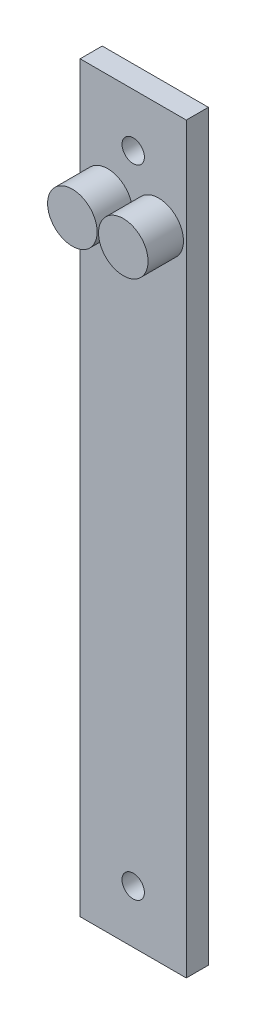
ISO-10303-21;
HEADER;
FILE_DESCRIPTION(('STEP AP214'),'2;1');
FILE_NAME('part.step','',(''),(''),'','','');
FILE_SCHEMA(('AUTOMOTIVE_DESIGN { 1 0 10303 214 1 1 1 1 }'));
ENDSEC;
DATA;
#1=APPLICATION_CONTEXT('core data for automotive mechanical design processes');
#2=APPLICATION_PROTOCOL_DEFINITION('international standard','automotive_design',2000,#1);
#3=PRODUCT_CONTEXT('',#1,'mechanical');
#4=PRODUCT('Part','Part','',(#3));
#5=PRODUCT_RELATED_PRODUCT_CATEGORY('part','',(#4));
#6=PRODUCT_DEFINITION_FORMATION('','',#4);
#7=PRODUCT_DEFINITION_CONTEXT('part definition',#1,'design');
#8=PRODUCT_DEFINITION('design','',#6,#7);
#9=PRODUCT_DEFINITION_SHAPE('','',#8);
#10=(LENGTH_UNIT() NAMED_UNIT(*) SI_UNIT(.MILLI.,.METRE.));
#11=(NAMED_UNIT(*) PLANE_ANGLE_UNIT() SI_UNIT($,.RADIAN.));
#12=(NAMED_UNIT(*) SI_UNIT($,.STERADIAN.) SOLID_ANGLE_UNIT());
#13=UNCERTAINTY_MEASURE_WITH_UNIT(LENGTH_MEASURE(1.E-05),#10,'distance_accuracy_value','');
#14=(GEOMETRIC_REPRESENTATION_CONTEXT(3) GLOBAL_UNCERTAINTY_ASSIGNED_CONTEXT((#13)) GLOBAL_UNIT_ASSIGNED_CONTEXT((#10,
#11,#12)) REPRESENTATION_CONTEXT('',''));
#15=CARTESIAN_POINT('',(0.,0.,0.));
#16=DIRECTION('',(0.,0.,1.));
#17=DIRECTION('',(1.,0.,0.));
#18=AXIS2_PLACEMENT_3D('',#15,#16,#17);
#19=CARTESIAN_POINT('',(0.,0.,7.9375));
#20=DIRECTION('',(0.,0.,1.));
#21=DIRECTION('',(1.,0.,0.));
#22=AXIS2_PLACEMENT_3D('',#19,#20,#21);
#23=PLANE('',#22);
#24=CARTESIAN_POINT('',(-9.14400000000001,95.25,7.9375));
#25=DIRECTION('',(0.,0.,1.));
#26=DIRECTION('',(1.,0.,0.));
#27=AXIS2_PLACEMENT_3D('',#24,#25,#26);
#28=CIRCLE('',#27,8.89);
#29=CARTESIAN_POINT('',(-0.254000000000013,95.25,7.9375));
#30=VERTEX_POINT('',#29);
#31=EDGE_CURVE('E126',#30,#30,#28,.T.);
#32=ORIENTED_EDGE('',*,*,#31,.F.);
#33=EDGE_LOOP('',(#32));
#34=FACE_BOUND('',#33,.T.);
#35=CARTESIAN_POINT('',(0.,-114.3,7.9375));
#36=DIRECTION('',(0.,0.,1.));
#37=DIRECTION('',(1.,0.,0.));
#38=AXIS2_PLACEMENT_3D('',#35,#36,#37);
#39=CIRCLE('',#38,4.0132);
#40=CARTESIAN_POINT('',(4.0132,-114.3,7.9375));
#41=VERTEX_POINT('',#40);
#42=EDGE_CURVE('E122',#41,#41,#39,.T.);
#43=ORIENTED_EDGE('',*,*,#42,.F.);
#44=EDGE_LOOP('',(#43));
#45=FACE_BOUND('',#44,.T.);
#46=CARTESIAN_POINT('',(0.,114.3,7.9375));
#47=DIRECTION('',(0.,0.,1.));
#48=DIRECTION('',(1.,0.,0.));
#49=AXIS2_PLACEMENT_3D('',#46,#47,#48);
#50=CIRCLE('',#49,4.0132);
#51=CARTESIAN_POINT('',(4.0132,114.3,7.9375));
#52=VERTEX_POINT('',#51);
#53=EDGE_CURVE('E116',#52,#52,#50,.T.);
#54=ORIENTED_EDGE('',*,*,#53,.F.);
#55=EDGE_LOOP('',(#54));
#56=FACE_BOUND('',#55,.T.);
#57=DIRECTION('',(0.,-1.,0.));
#58=VECTOR('',#57,1.);
#59=CARTESIAN_POINT('',(-19.05,133.35,7.9375));
#60=LINE('',#59,#58);
#61=CARTESIAN_POINT('',(-19.05,133.35,7.9375));
#62=VERTEX_POINT('',#61);
#63=CARTESIAN_POINT('',(-19.05,-133.35,7.9375));
#64=VERTEX_POINT('',#63);
#65=EDGE_CURVE('E88',#62,#64,#60,.T.);
#66=ORIENTED_EDGE('',*,*,#65,.T.);
#67=DIRECTION('',(1.,0.,0.));
#68=VECTOR('',#67,1.);
#69=CARTESIAN_POINT('',(-19.05,-133.35,7.9375));
#70=LINE('',#69,#68);
#71=CARTESIAN_POINT('',(19.05,-133.35,7.9375));
#72=VERTEX_POINT('',#71);
#73=EDGE_CURVE('E83',#64,#72,#70,.T.);
#74=ORIENTED_EDGE('',*,*,#73,.T.);
#75=DIRECTION('',(0.,1.,0.));
#76=VECTOR('',#75,1.);
#77=CARTESIAN_POINT('',(19.05,133.35,7.9375));
#78=LINE('',#77,#76);
#79=CARTESIAN_POINT('',(19.05,133.35,7.9375));
#80=VERTEX_POINT('',#79);
#81=EDGE_CURVE('E86',#72,#80,#78,.T.);
#82=ORIENTED_EDGE('',*,*,#81,.T.);
#83=DIRECTION('',(-1.,0.,0.));
#84=VECTOR('',#83,1.);
#85=CARTESIAN_POINT('',(-19.05,133.35,7.9375));
#86=LINE('',#85,#84);
#87=EDGE_CURVE('E53',#80,#62,#86,.T.);
#88=ORIENTED_EDGE('',*,*,#87,.T.);
#89=EDGE_LOOP('',(#66,#74,#82,#88));
#90=FACE_BOUND('',#89,.T.);
#91=CARTESIAN_POINT('',(9.14400000000002,95.25,7.9375));
#92=DIRECTION('',(0.,0.,1.));
#93=DIRECTION('',(1.,0.,0.));
#94=AXIS2_PLACEMENT_3D('',#91,#92,#93);
#95=CIRCLE('',#94,8.89);
#96=CARTESIAN_POINT('',(18.034,95.25,7.9375));
#97=VERTEX_POINT('',#96);
#98=EDGE_CURVE('E132',#97,#97,#95,.T.);
#99=ORIENTED_EDGE('',*,*,#98,.F.);
#100=EDGE_LOOP('',(#99));
#101=FACE_BOUND('',#100,.T.);
#102=ADVANCED_FACE('F36',(#34,#45,#56,#90,#101),#23,.T.);
#103=CARTESIAN_POINT('',(-19.05,133.35,7.9375));
#104=DIRECTION('',(1.,0.,0.));
#105=DIRECTION('',(0.,1.,0.));
#106=AXIS2_PLACEMENT_3D('',#103,#104,#105);
#107=PLANE('',#106);
#108=DIRECTION('',(0.,-1.,0.));
#109=VECTOR('',#108,1.);
#110=CARTESIAN_POINT('',(-19.05,133.35,0.));
#111=LINE('',#110,#109);
#112=CARTESIAN_POINT('',(-19.05,133.35,0.));
#113=VERTEX_POINT('',#112);
#114=CARTESIAN_POINT('',(-19.05,-133.35,0.));
#115=VERTEX_POINT('',#114);
#116=EDGE_CURVE('E100',#113,#115,#111,.T.);
#117=ORIENTED_EDGE('',*,*,#116,.T.);
#118=DIRECTION('',(0.,0.,-1.));
#119=VECTOR('',#118,1.);
#120=CARTESIAN_POINT('',(-19.05,-133.35,7.9375));
#121=LINE('',#120,#119);
#122=EDGE_CURVE('E11',#64,#115,#121,.T.);
#123=ORIENTED_EDGE('',*,*,#122,.F.);
#124=ORIENTED_EDGE('',*,*,#65,.F.);
#125=DIRECTION('',(0.,0.,-1.));
#126=VECTOR('',#125,1.);
#127=CARTESIAN_POINT('',(-19.05,133.35,7.9375));
#128=LINE('',#127,#126);
#129=EDGE_CURVE('E96',#62,#113,#128,.T.);
#130=ORIENTED_EDGE('',*,*,#129,.T.);
#131=EDGE_LOOP('',(#117,#123,#124,#130));
#132=FACE_BOUND('',#131,.T.);
#133=ADVANCED_FACE('F38',(#132),#107,.F.);
#134=CARTESIAN_POINT('',(-19.05,-133.35,7.9375));
#135=DIRECTION('',(0.,1.,0.));
#136=DIRECTION('',(0.,0.,1.));
#137=AXIS2_PLACEMENT_3D('',#134,#135,#136);
#138=PLANE('',#137);
#139=DIRECTION('',(1.,0.,0.));
#140=VECTOR('',#139,1.);
#141=CARTESIAN_POINT('',(-19.05,-133.35,0.));
#142=LINE('',#141,#140);
#143=CARTESIAN_POINT('',(19.05,-133.35,0.));
#144=VERTEX_POINT('',#143);
#145=EDGE_CURVE('E92',#115,#144,#142,.T.);
#146=ORIENTED_EDGE('',*,*,#145,.T.);
#147=DIRECTION('',(0.,0.,-1.));
#148=VECTOR('',#147,1.);
#149=CARTESIAN_POINT('',(19.05,-133.35,7.9375));
#150=LINE('',#149,#148);
#151=EDGE_CURVE('E45',#72,#144,#150,.T.);
#152=ORIENTED_EDGE('',*,*,#151,.F.);
#153=ORIENTED_EDGE('',*,*,#73,.F.);
#154=ORIENTED_EDGE('',*,*,#122,.T.);
#155=EDGE_LOOP('',(#146,#152,#153,#154));
#156=FACE_BOUND('',#155,.T.);
#157=ADVANCED_FACE('F91',(#156),#138,.F.);
#158=CARTESIAN_POINT('',(19.05,133.35,7.9375));
#159=DIRECTION('',(-1.,0.,0.));
#160=DIRECTION('',(0.,-1.,0.));
#161=AXIS2_PLACEMENT_3D('',#158,#159,#160);
#162=PLANE('',#161);
#163=DIRECTION('',(0.,1.,0.));
#164=VECTOR('',#163,1.);
#165=CARTESIAN_POINT('',(19.05,133.35,0.));
#166=LINE('',#165,#164);
#167=CARTESIAN_POINT('',(19.05,133.35,0.));
#168=VERTEX_POINT('',#167);
#169=EDGE_CURVE('E70',#144,#168,#166,.T.);
#170=ORIENTED_EDGE('',*,*,#169,.T.);
#171=DIRECTION('',(0.,0.,-1.));
#172=VECTOR('',#171,1.);
#173=CARTESIAN_POINT('',(19.05,133.35,7.9375));
#174=LINE('',#173,#172);
#175=EDGE_CURVE('E93',#80,#168,#174,.T.);
#176=ORIENTED_EDGE('',*,*,#175,.F.);
#177=ORIENTED_EDGE('',*,*,#81,.F.);
#178=ORIENTED_EDGE('',*,*,#151,.T.);
#179=EDGE_LOOP('',(#170,#176,#177,#178));
#180=FACE_BOUND('',#179,.T.);
#181=ADVANCED_FACE('F94',(#180),#162,.F.);
#182=CARTESIAN_POINT('',(-19.05,133.35,7.9375));
#183=DIRECTION('',(0.,-1.,0.));
#184=DIRECTION('',(0.,0.,-1.));
#185=AXIS2_PLACEMENT_3D('',#182,#183,#184);
#186=PLANE('',#185);
#187=DIRECTION('',(-1.,0.,0.));
#188=VECTOR('',#187,1.);
#189=CARTESIAN_POINT('',(-19.05,133.35,0.));
#190=LINE('',#189,#188);
#191=EDGE_CURVE('E76',#168,#113,#190,.T.);
#192=ORIENTED_EDGE('',*,*,#191,.T.);
#193=ORIENTED_EDGE('',*,*,#129,.F.);
#194=ORIENTED_EDGE('',*,*,#87,.F.);
#195=ORIENTED_EDGE('',*,*,#175,.T.);
#196=EDGE_LOOP('',(#192,#193,#194,#195));
#197=FACE_BOUND('',#196,.T.);
#198=ADVANCED_FACE('F108',(#197),#186,.F.);
#199=CARTESIAN_POINT('',(0.,0.,0.));
#200=DIRECTION('',(0.,0.,1.));
#201=DIRECTION('',(1.,0.,0.));
#202=AXIS2_PLACEMENT_3D('',#199,#200,#201);
#203=PLANE('',#202);
#204=CARTESIAN_POINT('',(0.,-114.3,0.));
#205=DIRECTION('',(0.,0.,1.));
#206=DIRECTION('',(1.,0.,0.));
#207=AXIS2_PLACEMENT_3D('',#204,#205,#206);
#208=CIRCLE('',#207,4.0132);
#209=CARTESIAN_POINT('',(4.0132,-114.3,0.));
#210=VERTEX_POINT('',#209);
#211=EDGE_CURVE('E119',#210,#210,#208,.T.);
#212=ORIENTED_EDGE('',*,*,#211,.T.);
#213=EDGE_LOOP('',(#212));
#214=FACE_BOUND('',#213,.T.);
#215=CARTESIAN_POINT('',(0.,114.3,0.));
#216=DIRECTION('',(0.,0.,1.));
#217=DIRECTION('',(1.,0.,0.));
#218=AXIS2_PLACEMENT_3D('',#215,#216,#217);
#219=CIRCLE('',#218,4.0132);
#220=CARTESIAN_POINT('',(4.0132,114.3,0.));
#221=VERTEX_POINT('',#220);
#222=EDGE_CURVE('E103',#221,#221,#219,.T.);
#223=ORIENTED_EDGE('',*,*,#222,.T.);
#224=EDGE_LOOP('',(#223));
#225=FACE_BOUND('',#224,.T.);
#226=ORIENTED_EDGE('',*,*,#116,.F.);
#227=ORIENTED_EDGE('',*,*,#191,.F.);
#228=ORIENTED_EDGE('',*,*,#169,.F.);
#229=ORIENTED_EDGE('',*,*,#145,.F.);
#230=EDGE_LOOP('',(#226,#227,#228,#229));
#231=FACE_BOUND('',#230,.T.);
#232=ADVANCED_FACE('F111',(#214,#225,#231),#203,.F.);
#233=CARTESIAN_POINT('',(0.,114.3,7.9375));
#234=DIRECTION('',(0.,0.,1.));
#235=DIRECTION('',(1.,0.,0.));
#236=AXIS2_PLACEMENT_3D('',#233,#234,#235);
#237=CYLINDRICAL_SURFACE('',#236,4.0132);
#238=ORIENTED_EDGE('',*,*,#222,.F.);
#239=EDGE_LOOP('',(#238));
#240=FACE_BOUND('',#239,.T.);
#241=ORIENTED_EDGE('',*,*,#53,.T.);
#242=EDGE_LOOP('',(#241));
#243=FACE_BOUND('',#242,.T.);
#244=ADVANCED_FACE('F156',(#240,#243),#237,.F.);
#245=CARTESIAN_POINT('',(0.,-114.3,7.9375));
#246=DIRECTION('',(0.,0.,1.));
#247=DIRECTION('',(1.,0.,0.));
#248=AXIS2_PLACEMENT_3D('',#245,#246,#247);
#249=CYLINDRICAL_SURFACE('',#248,4.0132);
#250=ORIENTED_EDGE('',*,*,#211,.F.);
#251=EDGE_LOOP('',(#250));
#252=FACE_BOUND('',#251,.T.);
#253=ORIENTED_EDGE('',*,*,#42,.T.);
#254=EDGE_LOOP('',(#253));
#255=FACE_BOUND('',#254,.T.);
#256=ADVANCED_FACE('F188',(#252,#255),#249,.F.);
#257=CARTESIAN_POINT('',(-9.14400000000001,95.25,20.6375));
#258=DIRECTION('',(0.,0.,-1.));
#259=DIRECTION('',(-1.,0.,0.));
#260=AXIS2_PLACEMENT_3D('',#257,#258,#259);
#261=CYLINDRICAL_SURFACE('',#260,8.89);
#262=CARTESIAN_POINT('',(-9.14400000000001,95.25,20.6375));
#263=DIRECTION('',(0.,0.,1.));
#264=DIRECTION('',(1.,0.,0.));
#265=AXIS2_PLACEMENT_3D('',#262,#263,#264);
#266=CIRCLE('',#265,8.89);
#267=CARTESIAN_POINT('',(-0.254000000000013,95.25,20.6375));
#268=VERTEX_POINT('',#267);
#269=EDGE_CURVE('E125',#268,#268,#266,.T.);
#270=ORIENTED_EDGE('',*,*,#269,.F.);
#271=EDGE_LOOP('',(#270));
#272=FACE_BOUND('',#271,.T.);
#273=ORIENTED_EDGE('',*,*,#31,.T.);
#274=EDGE_LOOP('',(#273));
#275=FACE_BOUND('',#274,.T.);
#276=ADVANCED_FACE('F194',(#272,#275),#261,.T.);
#277=CARTESIAN_POINT('',(-9.14400000000001,95.25,20.6375));
#278=DIRECTION('',(0.,0.,1.));
#279=DIRECTION('',(1.,0.,0.));
#280=AXIS2_PLACEMENT_3D('',#277,#278,#279);
#281=PLANE('',#280);
#282=ORIENTED_EDGE('',*,*,#269,.T.);
#283=EDGE_LOOP('',(#282));
#284=FACE_BOUND('',#283,.T.);
#285=ADVANCED_FACE('F143',(#284),#281,.T.);
#286=CARTESIAN_POINT('',(9.14400000000002,95.25,20.6375));
#287=DIRECTION('',(0.,0.,-1.));
#288=DIRECTION('',(-1.,0.,0.));
#289=AXIS2_PLACEMENT_3D('',#286,#287,#288);
#290=CYLINDRICAL_SURFACE('',#289,8.89);
#291=CARTESIAN_POINT('',(9.14400000000002,95.25,20.6375));
#292=DIRECTION('',(0.,0.,1.));
#293=DIRECTION('',(1.,0.,0.));
#294=AXIS2_PLACEMENT_3D('',#291,#292,#293);
#295=CIRCLE('',#294,8.89);
#296=CARTESIAN_POINT('',(18.034,95.25,20.6375));
#297=VERTEX_POINT('',#296);
#298=EDGE_CURVE('E129',#297,#297,#295,.T.);
#299=ORIENTED_EDGE('',*,*,#298,.F.);
#300=EDGE_LOOP('',(#299));
#301=FACE_BOUND('',#300,.T.);
#302=ORIENTED_EDGE('',*,*,#98,.T.);
#303=EDGE_LOOP('',(#302));
#304=FACE_BOUND('',#303,.T.);
#305=ADVANCED_FACE('F140',(#301,#304),#290,.T.);
#306=CARTESIAN_POINT('',(9.14400000000002,95.25,20.6375));
#307=DIRECTION('',(0.,0.,1.));
#308=DIRECTION('',(1.,0.,0.));
#309=AXIS2_PLACEMENT_3D('',#306,#307,#308);
#310=PLANE('',#309);
#311=ORIENTED_EDGE('',*,*,#298,.T.);
#312=EDGE_LOOP('',(#311));
#313=FACE_BOUND('',#312,.T.);
#314=ADVANCED_FACE('F138',(#313),#310,.T.);
#315=CLOSED_SHELL('',(#102,#133,#157,#181,#198,#232,#244,#256,#276,#285,#305,#314));
#316=MANIFOLD_SOLID_BREP('B2',#315);
#317=ADVANCED_BREP_SHAPE_REPRESENTATION('',(#18,#316),#14);
#318=SHAPE_DEFINITION_REPRESENTATION(#9,#317);
ENDSEC;
END-ISO-10303-21;
